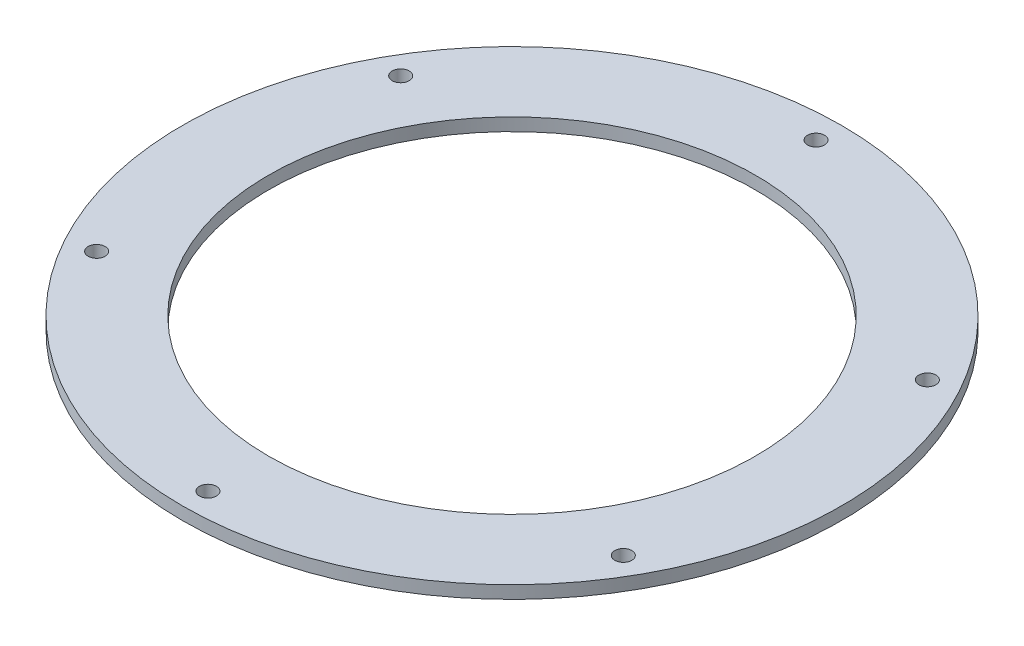
ISO-10303-21;
HEADER;
FILE_DESCRIPTION(('STEP AP214'),'2;1');
FILE_NAME('part.step','',(''),(''),'','','');
FILE_SCHEMA(('AUTOMOTIVE_DESIGN { 1 0 10303 214 1 1 1 1 }'));
ENDSEC;
DATA;
#1=APPLICATION_CONTEXT('core data for automotive mechanical design processes');
#2=APPLICATION_PROTOCOL_DEFINITION('international standard','automotive_design',2000,#1);
#3=PRODUCT_CONTEXT('',#1,'mechanical');
#4=PRODUCT('Part','Part','',(#3));
#5=PRODUCT_RELATED_PRODUCT_CATEGORY('part','',(#4));
#6=PRODUCT_DEFINITION_FORMATION('','',#4);
#7=PRODUCT_DEFINITION_CONTEXT('part definition',#1,'design');
#8=PRODUCT_DEFINITION('design','',#6,#7);
#9=PRODUCT_DEFINITION_SHAPE('','',#8);
#10=(LENGTH_UNIT() NAMED_UNIT(*) SI_UNIT(.MILLI.,.METRE.));
#11=(NAMED_UNIT(*) PLANE_ANGLE_UNIT() SI_UNIT($,.RADIAN.));
#12=(NAMED_UNIT(*) SI_UNIT($,.STERADIAN.) SOLID_ANGLE_UNIT());
#13=UNCERTAINTY_MEASURE_WITH_UNIT(LENGTH_MEASURE(1.E-05),#10,'distance_accuracy_value','');
#14=(GEOMETRIC_REPRESENTATION_CONTEXT(3) GLOBAL_UNCERTAINTY_ASSIGNED_CONTEXT((#13)) GLOBAL_UNIT_ASSIGNED_CONTEXT((#10,
#11,#12)) REPRESENTATION_CONTEXT('',''));
#15=CARTESIAN_POINT('',(0.,0.,0.));
#16=DIRECTION('',(0.,0.,1.));
#17=DIRECTION('',(1.,0.,0.));
#18=AXIS2_PLACEMENT_3D('',#15,#16,#17);
#19=CARTESIAN_POINT('',(0.,3.,0.));
#20=DIRECTION('',(0.,1.,0.));
#21=DIRECTION('',(0.,0.,1.));
#22=AXIS2_PLACEMENT_3D('',#19,#20,#21);
#23=PLANE('',#22);
#24=CARTESIAN_POINT('',(-61.9208163705824,3.,35.7500000000029));
#25=DIRECTION('',(0.,1.,0.));
#26=DIRECTION('',(0.,0.,1.));
#27=AXIS2_PLACEMENT_3D('',#24,#25,#26);
#28=CIRCLE('',#27,2.);
#29=CARTESIAN_POINT('',(-61.9208163705824,3.,37.7500000000029));
#30=VERTEX_POINT('',#29);
#31=EDGE_CURVE('E90',#30,#30,#28,.T.);
#32=ORIENTED_EDGE('',*,*,#31,.F.);
#33=EDGE_LOOP('',(#32));
#34=FACE_BOUND('',#33,.T.);
#35=CARTESIAN_POINT('',(61.9208163705924,3.,35.7499999999971));
#36=DIRECTION('',(0.,1.,0.));
#37=DIRECTION('',(0.,0.,1.));
#38=AXIS2_PLACEMENT_3D('',#35,#36,#37);
#39=CIRCLE('',#38,2.);
#40=CARTESIAN_POINT('',(61.9208163705924,3.,37.7499999999971));
#41=VERTEX_POINT('',#40);
#42=EDGE_CURVE('E74',#41,#41,#39,.T.);
#43=ORIENTED_EDGE('',*,*,#42,.F.);
#44=EDGE_LOOP('',(#43));
#45=FACE_BOUND('',#44,.T.);
#46=CARTESIAN_POINT('',(0.,3.,-71.5));
#47=DIRECTION('',(0.,1.,0.));
#48=DIRECTION('',(0.,0.,1.));
#49=AXIS2_PLACEMENT_3D('',#46,#47,#48);
#50=CIRCLE('',#49,2.);
#51=CARTESIAN_POINT('',(0.,3.,-69.5));
#52=VERTEX_POINT('',#51);
#53=EDGE_CURVE('E58',#52,#52,#50,.T.);
#54=ORIENTED_EDGE('',*,*,#53,.F.);
#55=EDGE_LOOP('',(#54));
#56=FACE_BOUND('',#55,.T.);
#57=CARTESIAN_POINT('',(0.,3.,0.));
#58=DIRECTION('',(0.,1.,0.));
#59=DIRECTION('',(0.,0.,1.));
#60=AXIS2_PLACEMENT_3D('',#57,#58,#59);
#61=CIRCLE('',#60,77.4975);
#62=CARTESIAN_POINT('',(0.,3.,77.4975));
#63=VERTEX_POINT('',#62);
#64=EDGE_CURVE('E10',#63,#63,#61,.T.);
#65=ORIENTED_EDGE('',*,*,#64,.T.);
#66=EDGE_LOOP('',(#65));
#67=FACE_BOUND('',#66,.T.);
#68=CARTESIAN_POINT('',(0.,3.,0.));
#69=DIRECTION('',(0.,1.,0.));
#70=DIRECTION('',(0.,0.,1.));
#71=AXIS2_PLACEMENT_3D('',#68,#69,#70);
#72=CIRCLE('',#71,57.240625);
#73=CARTESIAN_POINT('',(0.,3.,57.240625));
#74=VERTEX_POINT('',#73);
#75=EDGE_CURVE('E52',#74,#74,#72,.T.);
#76=ORIENTED_EDGE('',*,*,#75,.F.);
#77=EDGE_LOOP('',(#76));
#78=FACE_BOUND('',#77,.T.);
#79=CARTESIAN_POINT('',(61.920816370589,3.,-35.7500000000029));
#80=DIRECTION('',(0.,1.,0.));
#81=DIRECTION('',(0.,0.,1.));
#82=AXIS2_PLACEMENT_3D('',#79,#80,#81);
#83=CIRCLE('',#82,2.);
#84=CARTESIAN_POINT('',(61.920816370589,3.,-33.7500000000029));
#85=VERTEX_POINT('',#84);
#86=EDGE_CURVE('E66',#85,#85,#83,.T.);
#87=ORIENTED_EDGE('',*,*,#86,.F.);
#88=EDGE_LOOP('',(#87));
#89=FACE_BOUND('',#88,.T.);
#90=CARTESIAN_POINT('',(6.66361488598082E-12,3.,71.5));
#91=DIRECTION('',(0.,1.,0.));
#92=DIRECTION('',(0.,0.,1.));
#93=AXIS2_PLACEMENT_3D('',#90,#91,#92);
#94=CIRCLE('',#93,2.);
#95=CARTESIAN_POINT('',(6.66361488598082E-12,3.,73.5));
#96=VERTEX_POINT('',#95);
#97=EDGE_CURVE('E82',#96,#96,#94,.T.);
#98=ORIENTED_EDGE('',*,*,#97,.F.);
#99=EDGE_LOOP('',(#98));
#100=FACE_BOUND('',#99,.T.);
#101=CARTESIAN_POINT('',(-61.9208163705857,3.,-35.7499999999971));
#102=DIRECTION('',(0.,1.,0.));
#103=DIRECTION('',(0.,0.,1.));
#104=AXIS2_PLACEMENT_3D('',#101,#102,#103);
#105=CIRCLE('',#104,2.);
#106=CARTESIAN_POINT('',(-61.9208163705857,3.,-33.7499999999971));
#107=VERTEX_POINT('',#106);
#108=EDGE_CURVE('E98',#107,#107,#105,.T.);
#109=ORIENTED_EDGE('',*,*,#108,.F.);
#110=EDGE_LOOP('',(#109));
#111=FACE_BOUND('',#110,.T.);
#112=ADVANCED_FACE('F39',(#34,#45,#56,#67,#78,#89,#100,#111),#23,.T.);
#113=CARTESIAN_POINT('',(0.,0.,0.));
#114=DIRECTION('',(0.,1.,0.));
#115=DIRECTION('',(0.,0.,1.));
#116=AXIS2_PLACEMENT_3D('',#113,#114,#115);
#117=PLANE('',#116);
#118=CARTESIAN_POINT('',(0.,0.,0.));
#119=DIRECTION('',(0.,1.,0.));
#120=DIRECTION('',(0.,0.,1.));
#121=AXIS2_PLACEMENT_3D('',#118,#119,#120);
#122=CIRCLE('',#121,77.4975);
#123=CARTESIAN_POINT('',(0.,0.,77.4975));
#124=VERTEX_POINT('',#123);
#125=EDGE_CURVE('E43',#124,#124,#122,.T.);
#126=ORIENTED_EDGE('',*,*,#125,.F.);
#127=EDGE_LOOP('',(#126));
#128=FACE_BOUND('',#127,.T.);
#129=CARTESIAN_POINT('',(0.,0.,0.));
#130=DIRECTION('',(0.,1.,0.));
#131=DIRECTION('',(0.,0.,1.));
#132=AXIS2_PLACEMENT_3D('',#129,#130,#131);
#133=CIRCLE('',#132,57.240625);
#134=CARTESIAN_POINT('',(0.,0.,57.240625));
#135=VERTEX_POINT('',#134);
#136=EDGE_CURVE('E54',#135,#135,#133,.T.);
#137=ORIENTED_EDGE('',*,*,#136,.T.);
#138=EDGE_LOOP('',(#137));
#139=FACE_BOUND('',#138,.T.);
#140=CARTESIAN_POINT('',(0.,0.,-71.5));
#141=DIRECTION('',(0.,1.,0.));
#142=DIRECTION('',(0.,0.,1.));
#143=AXIS2_PLACEMENT_3D('',#140,#141,#142);
#144=CIRCLE('',#143,2.);
#145=CARTESIAN_POINT('',(0.,0.,-69.5));
#146=VERTEX_POINT('',#145);
#147=EDGE_CURVE('E62',#146,#146,#144,.T.);
#148=ORIENTED_EDGE('',*,*,#147,.T.);
#149=EDGE_LOOP('',(#148));
#150=FACE_BOUND('',#149,.T.);
#151=CARTESIAN_POINT('',(61.920816370589,0.,-35.7500000000029));
#152=DIRECTION('',(0.,1.,0.));
#153=DIRECTION('',(0.,0.,1.));
#154=AXIS2_PLACEMENT_3D('',#151,#152,#153);
#155=CIRCLE('',#154,2.);
#156=CARTESIAN_POINT('',(61.920816370589,0.,-33.7500000000029));
#157=VERTEX_POINT('',#156);
#158=EDGE_CURVE('E70',#157,#157,#155,.T.);
#159=ORIENTED_EDGE('',*,*,#158,.T.);
#160=EDGE_LOOP('',(#159));
#161=FACE_BOUND('',#160,.T.);
#162=CARTESIAN_POINT('',(61.9208163705924,0.,35.7499999999971));
#163=DIRECTION('',(0.,1.,0.));
#164=DIRECTION('',(0.,0.,1.));
#165=AXIS2_PLACEMENT_3D('',#162,#163,#164);
#166=CIRCLE('',#165,2.);
#167=CARTESIAN_POINT('',(61.9208163705924,0.,37.7499999999971));
#168=VERTEX_POINT('',#167);
#169=EDGE_CURVE('E78',#168,#168,#166,.T.);
#170=ORIENTED_EDGE('',*,*,#169,.T.);
#171=EDGE_LOOP('',(#170));
#172=FACE_BOUND('',#171,.T.);
#173=CARTESIAN_POINT('',(6.66361488598082E-12,0.,71.5));
#174=DIRECTION('',(0.,1.,0.));
#175=DIRECTION('',(0.,0.,1.));
#176=AXIS2_PLACEMENT_3D('',#173,#174,#175);
#177=CIRCLE('',#176,2.);
#178=CARTESIAN_POINT('',(6.66361488598082E-12,0.,73.5));
#179=VERTEX_POINT('',#178);
#180=EDGE_CURVE('E86',#179,#179,#177,.T.);
#181=ORIENTED_EDGE('',*,*,#180,.T.);
#182=EDGE_LOOP('',(#181));
#183=FACE_BOUND('',#182,.T.);
#184=CARTESIAN_POINT('',(-61.9208163705824,0.,35.7500000000029));
#185=DIRECTION('',(0.,1.,0.));
#186=DIRECTION('',(0.,0.,1.));
#187=AXIS2_PLACEMENT_3D('',#184,#185,#186);
#188=CIRCLE('',#187,2.);
#189=CARTESIAN_POINT('',(-61.9208163705824,0.,37.7500000000029));
#190=VERTEX_POINT('',#189);
#191=EDGE_CURVE('E94',#190,#190,#188,.T.);
#192=ORIENTED_EDGE('',*,*,#191,.T.);
#193=EDGE_LOOP('',(#192));
#194=FACE_BOUND('',#193,.T.);
#195=CARTESIAN_POINT('',(-61.9208163705857,0.,-35.7499999999971));
#196=DIRECTION('',(0.,1.,0.));
#197=DIRECTION('',(0.,0.,1.));
#198=AXIS2_PLACEMENT_3D('',#195,#196,#197);
#199=CIRCLE('',#198,2.);
#200=CARTESIAN_POINT('',(-61.9208163705857,0.,-33.7499999999971));
#201=VERTEX_POINT('',#200);
#202=EDGE_CURVE('E102',#201,#201,#199,.T.);
#203=ORIENTED_EDGE('',*,*,#202,.T.);
#204=EDGE_LOOP('',(#203));
#205=FACE_BOUND('',#204,.T.);
#206=ADVANCED_FACE('F114',(#128,#139,#150,#161,#172,#183,#194,#205),#117,.F.);
#207=CARTESIAN_POINT('',(0.,3.,0.));
#208=DIRECTION('',(0.,-1.,0.));
#209=DIRECTION('',(0.,0.,-1.));
#210=AXIS2_PLACEMENT_3D('',#207,#208,#209);
#211=CYLINDRICAL_SURFACE('',#210,77.4975);
#212=ORIENTED_EDGE('',*,*,#64,.F.);
#213=EDGE_LOOP('',(#212));
#214=FACE_BOUND('',#213,.T.);
#215=ORIENTED_EDGE('',*,*,#125,.T.);
#216=EDGE_LOOP('',(#215));
#217=FACE_BOUND('',#216,.T.);
#218=ADVANCED_FACE('F41',(#214,#217),#211,.T.);
#219=CARTESIAN_POINT('',(0.,3.,0.));
#220=DIRECTION('',(0.,-1.,0.));
#221=DIRECTION('',(0.,0.,-1.));
#222=AXIS2_PLACEMENT_3D('',#219,#220,#221);
#223=CYLINDRICAL_SURFACE('',#222,57.240625);
#224=ORIENTED_EDGE('',*,*,#75,.T.);
#225=EDGE_LOOP('',(#224));
#226=FACE_BOUND('',#225,.T.);
#227=ORIENTED_EDGE('',*,*,#136,.F.);
#228=EDGE_LOOP('',(#227));
#229=FACE_BOUND('',#228,.T.);
#230=ADVANCED_FACE('F124',(#226,#229),#223,.F.);
#231=CARTESIAN_POINT('',(0.,3.,-71.5));
#232=DIRECTION('',(0.,-1.,0.));
#233=DIRECTION('',(0.,0.,-1.));
#234=AXIS2_PLACEMENT_3D('',#231,#232,#233);
#235=CYLINDRICAL_SURFACE('',#234,2.);
#236=ORIENTED_EDGE('',*,*,#53,.T.);
#237=EDGE_LOOP('',(#236));
#238=FACE_BOUND('',#237,.T.);
#239=ORIENTED_EDGE('',*,*,#147,.F.);
#240=EDGE_LOOP('',(#239));
#241=FACE_BOUND('',#240,.T.);
#242=ADVANCED_FACE('F127',(#238,#241),#235,.F.);
#243=CARTESIAN_POINT('',(61.920816370589,3.,-35.7500000000029));
#244=DIRECTION('',(0.,-1.,0.));
#245=DIRECTION('',(0.,0.,-1.));
#246=AXIS2_PLACEMENT_3D('',#243,#244,#245);
#247=CYLINDRICAL_SURFACE('',#246,2.);
#248=ORIENTED_EDGE('',*,*,#86,.T.);
#249=EDGE_LOOP('',(#248));
#250=FACE_BOUND('',#249,.T.);
#251=ORIENTED_EDGE('',*,*,#158,.F.);
#252=EDGE_LOOP('',(#251));
#253=FACE_BOUND('',#252,.T.);
#254=ADVANCED_FACE('F131',(#250,#253),#247,.F.);
#255=CARTESIAN_POINT('',(61.9208163705924,3.,35.7499999999971));
#256=DIRECTION('',(0.,-1.,0.));
#257=DIRECTION('',(0.,0.,-1.));
#258=AXIS2_PLACEMENT_3D('',#255,#256,#257);
#259=CYLINDRICAL_SURFACE('',#258,2.);
#260=ORIENTED_EDGE('',*,*,#42,.T.);
#261=EDGE_LOOP('',(#260));
#262=FACE_BOUND('',#261,.T.);
#263=ORIENTED_EDGE('',*,*,#169,.F.);
#264=EDGE_LOOP('',(#263));
#265=FACE_BOUND('',#264,.T.);
#266=ADVANCED_FACE('F135',(#262,#265),#259,.F.);
#267=CARTESIAN_POINT('',(6.66361488598082E-12,3.,71.5));
#268=DIRECTION('',(0.,-1.,0.));
#269=DIRECTION('',(0.,0.,-1.));
#270=AXIS2_PLACEMENT_3D('',#267,#268,#269);
#271=CYLINDRICAL_SURFACE('',#270,2.);
#272=ORIENTED_EDGE('',*,*,#97,.T.);
#273=EDGE_LOOP('',(#272));
#274=FACE_BOUND('',#273,.T.);
#275=ORIENTED_EDGE('',*,*,#180,.F.);
#276=EDGE_LOOP('',(#275));
#277=FACE_BOUND('',#276,.T.);
#278=ADVANCED_FACE('F139',(#274,#277),#271,.F.);
#279=CARTESIAN_POINT('',(-61.9208163705824,3.,35.7500000000029));
#280=DIRECTION('',(0.,-1.,0.));
#281=DIRECTION('',(0.,0.,-1.));
#282=AXIS2_PLACEMENT_3D('',#279,#280,#281);
#283=CYLINDRICAL_SURFACE('',#282,2.);
#284=ORIENTED_EDGE('',*,*,#31,.T.);
#285=EDGE_LOOP('',(#284));
#286=FACE_BOUND('',#285,.T.);
#287=ORIENTED_EDGE('',*,*,#191,.F.);
#288=EDGE_LOOP('',(#287));
#289=FACE_BOUND('',#288,.T.);
#290=ADVANCED_FACE('F143',(#286,#289),#283,.F.);
#291=CARTESIAN_POINT('',(-61.9208163705857,3.,-35.7499999999971));
#292=DIRECTION('',(0.,-1.,0.));
#293=DIRECTION('',(0.,0.,-1.));
#294=AXIS2_PLACEMENT_3D('',#291,#292,#293);
#295=CYLINDRICAL_SURFACE('',#294,2.);
#296=ORIENTED_EDGE('',*,*,#108,.T.);
#297=EDGE_LOOP('',(#296));
#298=FACE_BOUND('',#297,.T.);
#299=ORIENTED_EDGE('',*,*,#202,.F.);
#300=EDGE_LOOP('',(#299));
#301=FACE_BOUND('',#300,.T.);
#302=ADVANCED_FACE('F110',(#298,#301),#295,.F.);
#303=CLOSED_SHELL('',(#112,#206,#218,#230,#242,#254,#266,#278,#290,#302));
#304=MANIFOLD_SOLID_BREP('B2',#303);
#305=ADVANCED_BREP_SHAPE_REPRESENTATION('',(#18,#304),#14);
#306=SHAPE_DEFINITION_REPRESENTATION(#9,#305);
ENDSEC;
END-ISO-10303-21;
